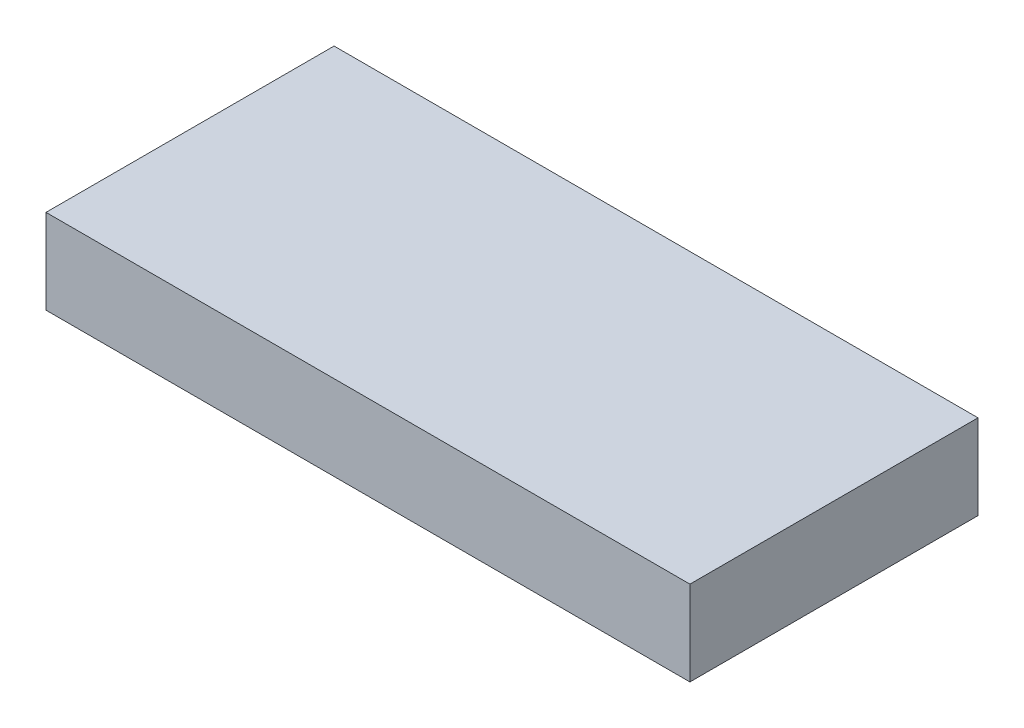
ISO-10303-21;
HEADER;
FILE_DESCRIPTION(('STEP AP214'),'2;1');
FILE_NAME('part.step','',(''),(''),'','','');
FILE_SCHEMA(('AUTOMOTIVE_DESIGN { 1 0 10303 214 1 1 1 1 }'));
ENDSEC;
DATA;
#1=APPLICATION_CONTEXT('core data for automotive mechanical design processes');
#2=APPLICATION_PROTOCOL_DEFINITION('international standard','automotive_design',2000,#1);
#3=PRODUCT_CONTEXT('',#1,'mechanical');
#4=PRODUCT('Part','Part','',(#3));
#5=PRODUCT_RELATED_PRODUCT_CATEGORY('part','',(#4));
#6=PRODUCT_DEFINITION_FORMATION('','',#4);
#7=PRODUCT_DEFINITION_CONTEXT('part definition',#1,'design');
#8=PRODUCT_DEFINITION('design','',#6,#7);
#9=PRODUCT_DEFINITION_SHAPE('','',#8);
#10=(LENGTH_UNIT() NAMED_UNIT(*) SI_UNIT(.MILLI.,.METRE.));
#11=(NAMED_UNIT(*) PLANE_ANGLE_UNIT() SI_UNIT($,.RADIAN.));
#12=(NAMED_UNIT(*) SI_UNIT($,.STERADIAN.) SOLID_ANGLE_UNIT());
#13=UNCERTAINTY_MEASURE_WITH_UNIT(LENGTH_MEASURE(1.E-05),#10,'distance_accuracy_value','');
#14=(GEOMETRIC_REPRESENTATION_CONTEXT(3) GLOBAL_UNCERTAINTY_ASSIGNED_CONTEXT((#13)) GLOBAL_UNIT_ASSIGNED_CONTEXT((#10,
#11,#12)) REPRESENTATION_CONTEXT('',''));
#15=CARTESIAN_POINT('',(0.,0.,0.));
#16=DIRECTION('',(0.,0.,1.));
#17=DIRECTION('',(1.,0.,0.));
#18=AXIS2_PLACEMENT_3D('',#15,#16,#17);
#19=CARTESIAN_POINT('',(19.,5.,-8.5));
#20=DIRECTION('',(-1.,0.,0.));
#21=DIRECTION('',(0.,0.,1.));
#22=AXIS2_PLACEMENT_3D('',#19,#20,#21);
#23=PLANE('',#22);
#24=DIRECTION('',(0.,0.,-1.));
#25=VECTOR('',#24,1.);
#26=CARTESIAN_POINT('',(19.,0.,-8.5));
#27=LINE('',#26,#25);
#28=CARTESIAN_POINT('',(19.,0.,8.5));
#29=VERTEX_POINT('',#28);
#30=CARTESIAN_POINT('',(19.,0.,-8.5));
#31=VERTEX_POINT('',#30);
#32=EDGE_CURVE('E113',#29,#31,#27,.T.);
#33=ORIENTED_EDGE('',*,*,#32,.T.);
#34=DIRECTION('',(0.,-1.,0.));
#35=VECTOR('',#34,1.);
#36=CARTESIAN_POINT('',(19.,5.,-8.5));
#37=LINE('',#36,#35);
#38=CARTESIAN_POINT('',(19.,5.,-8.5));
#39=VERTEX_POINT('',#38);
#40=EDGE_CURVE('E11',#39,#31,#37,.T.);
#41=ORIENTED_EDGE('',*,*,#40,.F.);
#42=DIRECTION('',(0.,0.,-1.));
#43=VECTOR('',#42,1.);
#44=CARTESIAN_POINT('',(19.,5.,-8.5));
#45=LINE('',#44,#43);
#46=CARTESIAN_POINT('',(19.,5.,8.5));
#47=VERTEX_POINT('',#46);
#48=EDGE_CURVE('E97',#47,#39,#45,.T.);
#49=ORIENTED_EDGE('',*,*,#48,.F.);
#50=DIRECTION('',(0.,-1.,0.));
#51=VECTOR('',#50,1.);
#52=CARTESIAN_POINT('',(19.,5.,8.5));
#53=LINE('',#52,#51);
#54=EDGE_CURVE('E109',#47,#29,#53,.T.);
#55=ORIENTED_EDGE('',*,*,#54,.T.);
#56=EDGE_LOOP('',(#33,#41,#49,#55));
#57=FACE_BOUND('',#56,.T.);
#58=ADVANCED_FACE('F45',(#57),#23,.F.);
#59=CARTESIAN_POINT('',(-19.,5.,-8.5));
#60=DIRECTION('',(0.,0.,1.));
#61=DIRECTION('',(1.,0.,0.));
#62=AXIS2_PLACEMENT_3D('',#59,#60,#61);
#63=PLANE('',#62);
#64=DIRECTION('',(-1.,0.,0.));
#65=VECTOR('',#64,1.);
#66=CARTESIAN_POINT('',(-19.,0.,-8.5));
#67=LINE('',#66,#65);
#68=CARTESIAN_POINT('',(-19.,0.,-8.5));
#69=VERTEX_POINT('',#68);
#70=EDGE_CURVE('E102',#31,#69,#67,.T.);
#71=ORIENTED_EDGE('',*,*,#70,.T.);
#72=DIRECTION('',(0.,-1.,0.));
#73=VECTOR('',#72,1.);
#74=CARTESIAN_POINT('',(-19.,5.,-8.5));
#75=LINE('',#74,#73);
#76=CARTESIAN_POINT('',(-19.,5.,-8.5));
#77=VERTEX_POINT('',#76);
#78=EDGE_CURVE('E54',#77,#69,#75,.T.);
#79=ORIENTED_EDGE('',*,*,#78,.F.);
#80=DIRECTION('',(-1.,0.,0.));
#81=VECTOR('',#80,1.);
#82=CARTESIAN_POINT('',(-19.,5.,-8.5));
#83=LINE('',#82,#81);
#84=EDGE_CURVE('E92',#39,#77,#83,.T.);
#85=ORIENTED_EDGE('',*,*,#84,.F.);
#86=ORIENTED_EDGE('',*,*,#40,.T.);
#87=EDGE_LOOP('',(#71,#79,#85,#86));
#88=FACE_BOUND('',#87,.T.);
#89=ADVANCED_FACE('F101',(#88),#63,.F.);
#90=CARTESIAN_POINT('',(-19.,5.,-8.5));
#91=DIRECTION('',(1.,0.,0.));
#92=DIRECTION('',(0.,0.,-1.));
#93=AXIS2_PLACEMENT_3D('',#90,#91,#92);
#94=PLANE('',#93);
#95=DIRECTION('',(0.,0.,1.));
#96=VECTOR('',#95,1.);
#97=CARTESIAN_POINT('',(-19.,0.,-8.5));
#98=LINE('',#97,#96);
#99=CARTESIAN_POINT('',(-19.,0.,8.5));
#100=VERTEX_POINT('',#99);
#101=EDGE_CURVE('E79',#69,#100,#98,.T.);
#102=ORIENTED_EDGE('',*,*,#101,.T.);
#103=DIRECTION('',(0.,-1.,0.));
#104=VECTOR('',#103,1.);
#105=CARTESIAN_POINT('',(-19.,5.,8.5));
#106=LINE('',#105,#104);
#107=CARTESIAN_POINT('',(-19.,5.,8.5));
#108=VERTEX_POINT('',#107);
#109=EDGE_CURVE('E104',#108,#100,#106,.T.);
#110=ORIENTED_EDGE('',*,*,#109,.F.);
#111=DIRECTION('',(0.,0.,1.));
#112=VECTOR('',#111,1.);
#113=CARTESIAN_POINT('',(-19.,5.,-8.5));
#114=LINE('',#113,#112);
#115=EDGE_CURVE('E95',#77,#108,#114,.T.);
#116=ORIENTED_EDGE('',*,*,#115,.F.);
#117=ORIENTED_EDGE('',*,*,#78,.T.);
#118=EDGE_LOOP('',(#102,#110,#116,#117));
#119=FACE_BOUND('',#118,.T.);
#120=ADVANCED_FACE('F105',(#119),#94,.F.);
#121=CARTESIAN_POINT('',(-19.,5.,8.5));
#122=DIRECTION('',(0.,0.,-1.));
#123=DIRECTION('',(-1.,0.,0.));
#124=AXIS2_PLACEMENT_3D('',#121,#122,#123);
#125=PLANE('',#124);
#126=DIRECTION('',(1.,0.,0.));
#127=VECTOR('',#126,1.);
#128=CARTESIAN_POINT('',(-19.,0.,8.5));
#129=LINE('',#128,#127);
#130=EDGE_CURVE('E85',#100,#29,#129,.T.);
#131=ORIENTED_EDGE('',*,*,#130,.T.);
#132=ORIENTED_EDGE('',*,*,#54,.F.);
#133=DIRECTION('',(1.,0.,0.));
#134=VECTOR('',#133,1.);
#135=CARTESIAN_POINT('',(-19.,5.,8.5));
#136=LINE('',#135,#134);
#137=EDGE_CURVE('E62',#108,#47,#136,.T.);
#138=ORIENTED_EDGE('',*,*,#137,.F.);
#139=ORIENTED_EDGE('',*,*,#109,.T.);
#140=EDGE_LOOP('',(#131,#132,#138,#139));
#141=FACE_BOUND('',#140,.T.);
#142=ADVANCED_FACE('F126',(#141),#125,.F.);
#143=CARTESIAN_POINT('',(0.,5.,0.));
#144=DIRECTION('',(0.,1.,0.));
#145=DIRECTION('',(0.,0.,1.));
#146=AXIS2_PLACEMENT_3D('',#143,#144,#145);
#147=PLANE('',#146);
#148=ORIENTED_EDGE('',*,*,#48,.T.);
#149=ORIENTED_EDGE('',*,*,#84,.T.);
#150=ORIENTED_EDGE('',*,*,#115,.T.);
#151=ORIENTED_EDGE('',*,*,#137,.T.);
#152=EDGE_LOOP('',(#148,#149,#150,#151));
#153=FACE_BOUND('',#152,.T.);
#154=ADVANCED_FACE('F93',(#153),#147,.T.);
#155=CARTESIAN_POINT('',(0.,0.,0.));
#156=DIRECTION('',(0.,1.,0.));
#157=DIRECTION('',(0.,0.,1.));
#158=AXIS2_PLACEMENT_3D('',#155,#156,#157);
#159=PLANE('',#158);
#160=ORIENTED_EDGE('',*,*,#32,.F.);
#161=ORIENTED_EDGE('',*,*,#130,.F.);
#162=ORIENTED_EDGE('',*,*,#101,.F.);
#163=ORIENTED_EDGE('',*,*,#70,.F.);
#164=EDGE_LOOP('',(#160,#161,#162,#163));
#165=FACE_BOUND('',#164,.T.);
#166=ADVANCED_FACE('F129',(#165),#159,.F.);
#167=CLOSED_SHELL('',(#58,#89,#120,#142,#154,#166));
#168=MANIFOLD_SOLID_BREP('B2',#167);
#169=ADVANCED_BREP_SHAPE_REPRESENTATION('',(#18,#168),#14);
#170=SHAPE_DEFINITION_REPRESENTATION(#9,#169);
ENDSEC;
END-ISO-10303-21;
